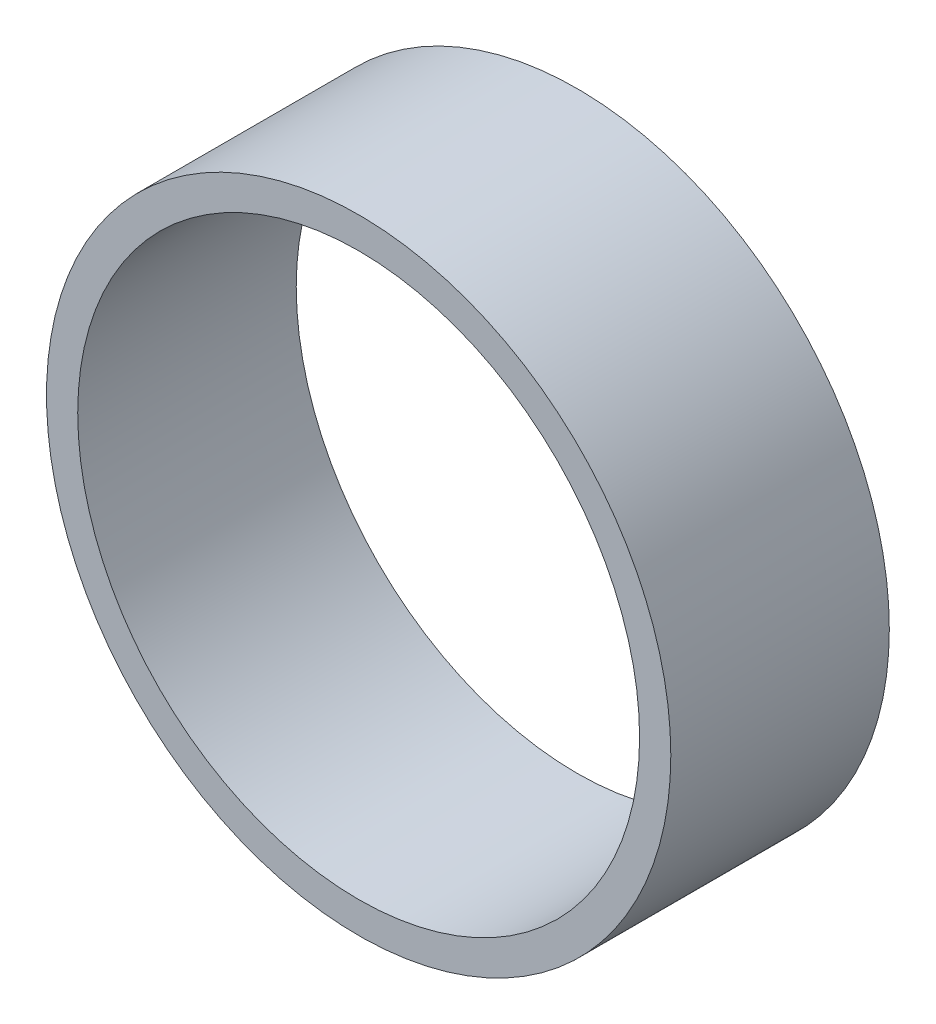
ISO-10303-21;
HEADER;
FILE_DESCRIPTION(('STEP AP214'),'2;1');
FILE_NAME('part.step','',(''),(''),'','','');
FILE_SCHEMA(('AUTOMOTIVE_DESIGN { 1 0 10303 214 1 1 1 1 }'));
ENDSEC;
DATA;
#1=APPLICATION_CONTEXT('core data for automotive mechanical design processes');
#2=APPLICATION_PROTOCOL_DEFINITION('international standard','automotive_design',2000,#1);
#3=PRODUCT_CONTEXT('',#1,'mechanical');
#4=PRODUCT('Part','Part','',(#3));
#5=PRODUCT_RELATED_PRODUCT_CATEGORY('part','',(#4));
#6=PRODUCT_DEFINITION_FORMATION('','',#4);
#7=PRODUCT_DEFINITION_CONTEXT('part definition',#1,'design');
#8=PRODUCT_DEFINITION('design','',#6,#7);
#9=PRODUCT_DEFINITION_SHAPE('','',#8);
#10=(LENGTH_UNIT() NAMED_UNIT(*) SI_UNIT(.MILLI.,.METRE.));
#11=(NAMED_UNIT(*) PLANE_ANGLE_UNIT() SI_UNIT($,.RADIAN.));
#12=(NAMED_UNIT(*) SI_UNIT($,.STERADIAN.) SOLID_ANGLE_UNIT());
#13=UNCERTAINTY_MEASURE_WITH_UNIT(LENGTH_MEASURE(1.E-05),#10,'distance_accuracy_value','');
#14=(GEOMETRIC_REPRESENTATION_CONTEXT(3) GLOBAL_UNCERTAINTY_ASSIGNED_CONTEXT((#13)) GLOBAL_UNIT_ASSIGNED_CONTEXT((#10,
#11,#12)) REPRESENTATION_CONTEXT('',''));
#15=CARTESIAN_POINT('',(0.,0.,0.));
#16=DIRECTION('',(0.,0.,1.));
#17=DIRECTION('',(1.,0.,0.));
#18=AXIS2_PLACEMENT_3D('',#15,#16,#17);
#19=CARTESIAN_POINT('',(0.,0.,-7.));
#20=DIRECTION('',(0.,0.,-1.));
#21=DIRECTION('',(1.,0.,0.));
#22=AXIS2_PLACEMENT_3D('',#19,#20,#21);
#23=PLANE('',#22);
#24=CARTESIAN_POINT('',(0.,0.,-7.));
#25=DIRECTION('',(0.,0.,1.));
#26=DIRECTION('',(1.,0.,0.));
#27=AXIS2_PLACEMENT_3D('',#24,#25,#26);
#28=CIRCLE('',#27,10.);
#29=CARTESIAN_POINT('',(10.,0.,-7.));
#30=VERTEX_POINT('',#29);
#31=EDGE_CURVE('E10',#30,#30,#28,.T.);
#32=ORIENTED_EDGE('',*,*,#31,.F.);
#33=EDGE_LOOP('',(#32));
#34=FACE_BOUND('',#33,.T.);
#35=CARTESIAN_POINT('',(0.,0.,-7.));
#36=DIRECTION('',(0.,0.,1.));
#37=DIRECTION('',(1.,0.,0.));
#38=AXIS2_PLACEMENT_3D('',#35,#36,#37);
#39=CIRCLE('',#38,9.);
#40=CARTESIAN_POINT('',(9.,0.,-7.));
#41=VERTEX_POINT('',#40);
#42=EDGE_CURVE('E46',#41,#41,#39,.T.);
#43=ORIENTED_EDGE('',*,*,#42,.T.);
#44=EDGE_LOOP('',(#43));
#45=FACE_BOUND('',#44,.T.);
#46=ADVANCED_FACE('F35',(#34,#45),#23,.T.);
#47=CARTESIAN_POINT('',(0.,0.,0.));
#48=DIRECTION('',(0.,0.,-1.));
#49=DIRECTION('',(1.,0.,0.));
#50=AXIS2_PLACEMENT_3D('',#47,#48,#49);
#51=PLANE('',#50);
#52=CARTESIAN_POINT('',(0.,0.,0.));
#53=DIRECTION('',(0.,0.,1.));
#54=DIRECTION('',(1.,0.,0.));
#55=AXIS2_PLACEMENT_3D('',#52,#53,#54);
#56=CIRCLE('',#55,10.);
#57=CARTESIAN_POINT('',(10.,0.,0.));
#58=VERTEX_POINT('',#57);
#59=EDGE_CURVE('E39',#58,#58,#56,.T.);
#60=ORIENTED_EDGE('',*,*,#59,.T.);
#61=EDGE_LOOP('',(#60));
#62=FACE_BOUND('',#61,.T.);
#63=CARTESIAN_POINT('',(0.,0.,0.));
#64=DIRECTION('',(0.,0.,1.));
#65=DIRECTION('',(1.,0.,0.));
#66=AXIS2_PLACEMENT_3D('',#63,#64,#65);
#67=CIRCLE('',#66,9.);
#68=CARTESIAN_POINT('',(9.,0.,0.));
#69=VERTEX_POINT('',#68);
#70=EDGE_CURVE('E48',#69,#69,#67,.T.);
#71=ORIENTED_EDGE('',*,*,#70,.F.);
#72=EDGE_LOOP('',(#71));
#73=FACE_BOUND('',#72,.T.);
#74=ADVANCED_FACE('F61',(#62,#73),#51,.F.);
#75=CARTESIAN_POINT('',(0.,0.,-7.));
#76=DIRECTION('',(0.,0.,1.));
#77=DIRECTION('',(-1.,0.,0.));
#78=AXIS2_PLACEMENT_3D('',#75,#76,#77);
#79=CYLINDRICAL_SURFACE('',#78,10.);
#80=ORIENTED_EDGE('',*,*,#31,.T.);
#81=EDGE_LOOP('',(#80));
#82=FACE_BOUND('',#81,.T.);
#83=ORIENTED_EDGE('',*,*,#59,.F.);
#84=EDGE_LOOP('',(#83));
#85=FACE_BOUND('',#84,.T.);
#86=ADVANCED_FACE('F37',(#82,#85),#79,.T.);
#87=CARTESIAN_POINT('',(0.,0.,-7.));
#88=DIRECTION('',(0.,0.,1.));
#89=DIRECTION('',(-1.,0.,0.));
#90=AXIS2_PLACEMENT_3D('',#87,#88,#89);
#91=CYLINDRICAL_SURFACE('',#90,9.);
#92=ORIENTED_EDGE('',*,*,#42,.F.);
#93=EDGE_LOOP('',(#92));
#94=FACE_BOUND('',#93,.T.);
#95=ORIENTED_EDGE('',*,*,#70,.T.);
#96=EDGE_LOOP('',(#95));
#97=FACE_BOUND('',#96,.T.);
#98=ADVANCED_FACE('F55',(#94,#97),#91,.F.);
#99=CLOSED_SHELL('',(#46,#74,#86,#98));
#100=MANIFOLD_SOLID_BREP('B2',#99);
#101=ADVANCED_BREP_SHAPE_REPRESENTATION('',(#18,#100),#14);
#102=SHAPE_DEFINITION_REPRESENTATION(#9,#101);
ENDSEC;
END-ISO-10303-21;
